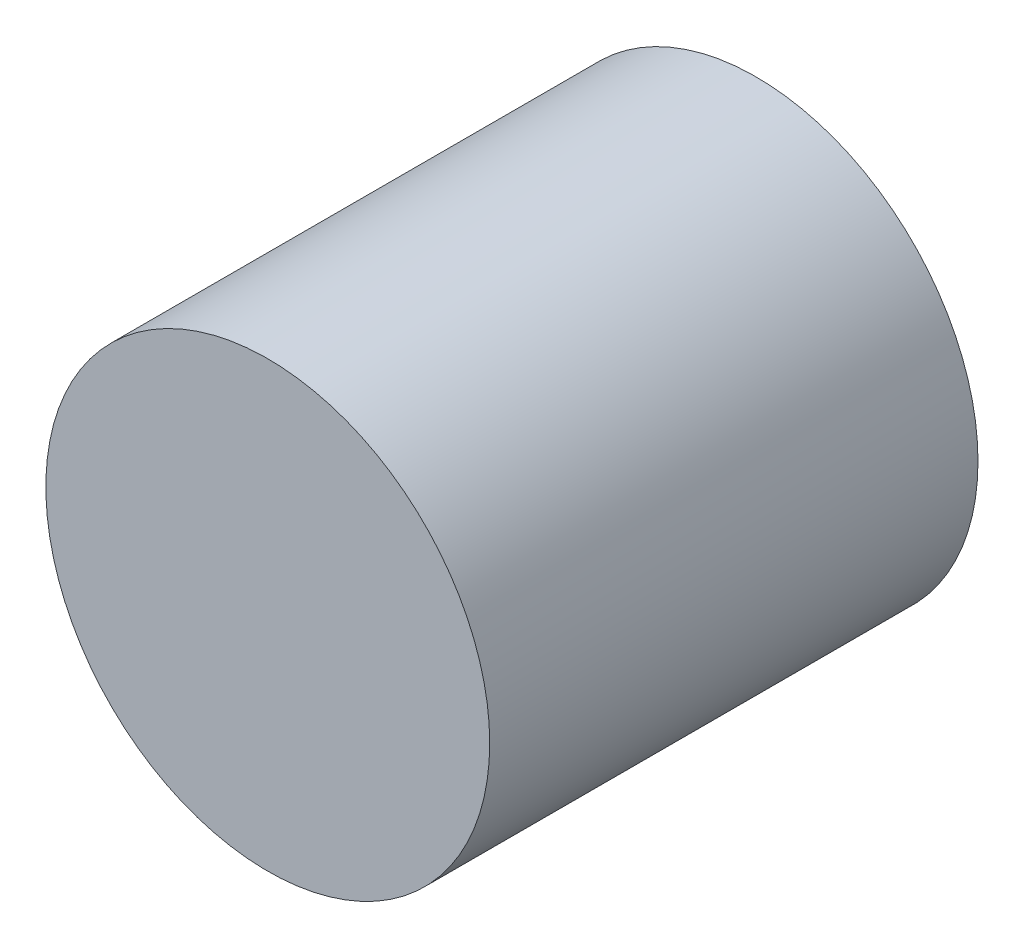
ISO-10303-21;
HEADER;
FILE_DESCRIPTION(('STEP AP214'),'2;1');
FILE_NAME('part.step','',(''),(''),'','','');
FILE_SCHEMA(('AUTOMOTIVE_DESIGN { 1 0 10303 214 1 1 1 1 }'));
ENDSEC;
DATA;
#1=APPLICATION_CONTEXT('core data for automotive mechanical design processes');
#2=APPLICATION_PROTOCOL_DEFINITION('international standard','automotive_design',2000,#1);
#3=PRODUCT_CONTEXT('',#1,'mechanical');
#4=PRODUCT('Part','Part','',(#3));
#5=PRODUCT_RELATED_PRODUCT_CATEGORY('part','',(#4));
#6=PRODUCT_DEFINITION_FORMATION('','',#4);
#7=PRODUCT_DEFINITION_CONTEXT('part definition',#1,'design');
#8=PRODUCT_DEFINITION('design','',#6,#7);
#9=PRODUCT_DEFINITION_SHAPE('','',#8);
#10=(LENGTH_UNIT() NAMED_UNIT(*) SI_UNIT(.MILLI.,.METRE.));
#11=(NAMED_UNIT(*) PLANE_ANGLE_UNIT() SI_UNIT($,.RADIAN.));
#12=(NAMED_UNIT(*) SI_UNIT($,.STERADIAN.) SOLID_ANGLE_UNIT());
#13=UNCERTAINTY_MEASURE_WITH_UNIT(LENGTH_MEASURE(1.E-05),#10,'distance_accuracy_value','');
#14=(GEOMETRIC_REPRESENTATION_CONTEXT(3) GLOBAL_UNCERTAINTY_ASSIGNED_CONTEXT((#13)) GLOBAL_UNIT_ASSIGNED_CONTEXT((#10,
#11,#12)) REPRESENTATION_CONTEXT('',''));
#15=CARTESIAN_POINT('',(0.,0.,0.));
#16=DIRECTION('',(0.,0.,1.));
#17=DIRECTION('',(1.,0.,0.));
#18=AXIS2_PLACEMENT_3D('',#15,#16,#17);
#19=CARTESIAN_POINT('',(0.,0.,11.));
#20=DIRECTION('',(0.,0.,-1.));
#21=DIRECTION('',(-1.,0.,0.));
#22=AXIS2_PLACEMENT_3D('',#19,#20,#21);
#23=CYLINDRICAL_SURFACE('',#22,5.);
#24=CARTESIAN_POINT('',(0.,0.,11.));
#25=DIRECTION('',(0.,0.,1.));
#26=DIRECTION('',(1.,0.,0.));
#27=AXIS2_PLACEMENT_3D('',#24,#25,#26);
#28=CIRCLE('',#27,5.);
#29=CARTESIAN_POINT('',(5.,0.,11.));
#30=VERTEX_POINT('',#29);
#31=EDGE_CURVE('E10',#30,#30,#28,.T.);
#32=ORIENTED_EDGE('',*,*,#31,.F.);
#33=EDGE_LOOP('',(#32));
#34=FACE_BOUND('',#33,.T.);
#35=CARTESIAN_POINT('',(0.,0.,0.));
#36=DIRECTION('',(0.,0.,1.));
#37=DIRECTION('',(1.,0.,0.));
#38=AXIS2_PLACEMENT_3D('',#35,#36,#37);
#39=CIRCLE('',#38,5.);
#40=CARTESIAN_POINT('',(5.,0.,0.));
#41=VERTEX_POINT('',#40);
#42=EDGE_CURVE('E36',#41,#41,#39,.T.);
#43=ORIENTED_EDGE('',*,*,#42,.T.);
#44=EDGE_LOOP('',(#43));
#45=FACE_BOUND('',#44,.T.);
#46=ADVANCED_FACE('F33',(#34,#45),#23,.T.);
#47=CARTESIAN_POINT('',(0.,0.,11.));
#48=DIRECTION('',(0.,0.,1.));
#49=DIRECTION('',(1.,0.,0.));
#50=AXIS2_PLACEMENT_3D('',#47,#48,#49);
#51=PLANE('',#50);
#52=ORIENTED_EDGE('',*,*,#31,.T.);
#53=EDGE_LOOP('',(#52));
#54=FACE_BOUND('',#53,.T.);
#55=ADVANCED_FACE('F48',(#54),#51,.T.);
#56=CARTESIAN_POINT('',(0.,0.,0.));
#57=DIRECTION('',(0.,0.,1.));
#58=DIRECTION('',(1.,0.,0.));
#59=AXIS2_PLACEMENT_3D('',#56,#57,#58);
#60=PLANE('',#59);
#61=ORIENTED_EDGE('',*,*,#42,.F.);
#62=EDGE_LOOP('',(#61));
#63=FACE_BOUND('',#62,.T.);
#64=ADVANCED_FACE('F46',(#63),#60,.F.);
#65=CLOSED_SHELL('',(#46,#55,#64));
#66=MANIFOLD_SOLID_BREP('B2',#65);
#67=ADVANCED_BREP_SHAPE_REPRESENTATION('',(#18,#66),#14);
#68=SHAPE_DEFINITION_REPRESENTATION(#9,#67);
ENDSEC;
END-ISO-10303-21;
